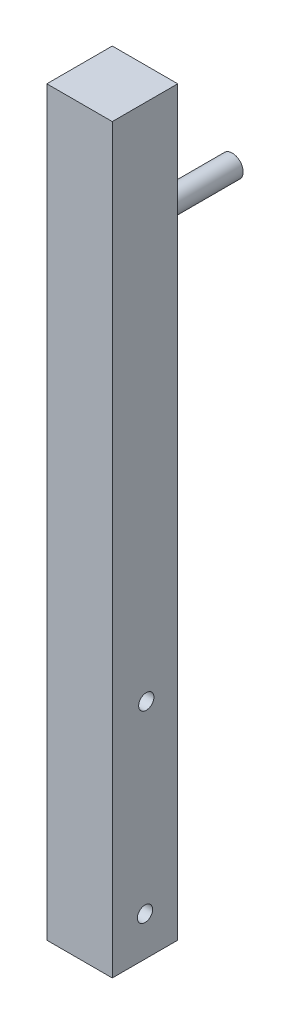
ISO-10303-21;
HEADER;
FILE_DESCRIPTION(('STEP AP214'),'2;1');
FILE_NAME('part.step','',(''),(''),'','','');
FILE_SCHEMA(('AUTOMOTIVE_DESIGN { 1 0 10303 214 1 1 1 1 }'));
ENDSEC;
DATA;
#1=APPLICATION_CONTEXT('core data for automotive mechanical design processes');
#2=APPLICATION_PROTOCOL_DEFINITION('international standard','automotive_design',2000,#1);
#3=PRODUCT_CONTEXT('',#1,'mechanical');
#4=PRODUCT('Part','Part','',(#3));
#5=PRODUCT_RELATED_PRODUCT_CATEGORY('part','',(#4));
#6=PRODUCT_DEFINITION_FORMATION('','',#4);
#7=PRODUCT_DEFINITION_CONTEXT('part definition',#1,'design');
#8=PRODUCT_DEFINITION('design','',#6,#7);
#9=PRODUCT_DEFINITION_SHAPE('','',#8);
#10=(LENGTH_UNIT() NAMED_UNIT(*) SI_UNIT(.MILLI.,.METRE.));
#11=(NAMED_UNIT(*) PLANE_ANGLE_UNIT() SI_UNIT($,.RADIAN.));
#12=(NAMED_UNIT(*) SI_UNIT($,.STERADIAN.) SOLID_ANGLE_UNIT());
#13=UNCERTAINTY_MEASURE_WITH_UNIT(LENGTH_MEASURE(1.E-05),#10,'distance_accuracy_value','');
#14=(GEOMETRIC_REPRESENTATION_CONTEXT(3) GLOBAL_UNCERTAINTY_ASSIGNED_CONTEXT((#13)) GLOBAL_UNIT_ASSIGNED_CONTEXT((#10,
#11,#12)) REPRESENTATION_CONTEXT('',''));
#15=CARTESIAN_POINT('',(0.,0.,0.));
#16=DIRECTION('',(0.,0.,1.));
#17=DIRECTION('',(1.,0.,0.));
#18=AXIS2_PLACEMENT_3D('',#15,#16,#17);
#19=CARTESIAN_POINT('',(-7.5,170.,-7.5));
#20=DIRECTION('',(0.,0.,1.));
#21=DIRECTION('',(1.,0.,0.));
#22=AXIS2_PLACEMENT_3D('',#19,#20,#21);
#23=PLANE('',#22);
#24=DIRECTION('',(-1.,0.,0.));
#25=VECTOR('',#24,1.);
#26=CARTESIAN_POINT('',(-7.5,0.,-7.5));
#27=LINE('',#26,#25);
#28=CARTESIAN_POINT('',(7.5,0.,-7.5));
#29=VERTEX_POINT('',#28);
#30=CARTESIAN_POINT('',(-7.5,0.,-7.5));
#31=VERTEX_POINT('',#30);
#32=EDGE_CURVE('E75',#29,#31,#27,.T.);
#33=ORIENTED_EDGE('',*,*,#32,.T.);
#34=DIRECTION('',(0.,-1.,0.));
#35=VECTOR('',#34,1.);
#36=CARTESIAN_POINT('',(-7.5,170.,-7.5));
#37=LINE('',#36,#35);
#38=CARTESIAN_POINT('',(-7.5,170.,-7.5));
#39=VERTEX_POINT('',#38);
#40=EDGE_CURVE('E98',#39,#31,#37,.T.);
#41=ORIENTED_EDGE('',*,*,#40,.F.);
#42=DIRECTION('',(-1.,0.,0.));
#43=VECTOR('',#42,1.);
#44=CARTESIAN_POINT('',(-7.5,170.,-7.5));
#45=LINE('',#44,#43);
#46=CARTESIAN_POINT('',(7.5,170.,-7.5));
#47=VERTEX_POINT('',#46);
#48=EDGE_CURVE('E52',#47,#39,#45,.T.);
#49=ORIENTED_EDGE('',*,*,#48,.F.);
#50=DIRECTION('',(0.,-1.,0.));
#51=VECTOR('',#50,1.);
#52=CARTESIAN_POINT('',(7.5,170.,-7.5));
#53=LINE('',#52,#51);
#54=EDGE_CURVE('E94',#47,#29,#53,.T.);
#55=ORIENTED_EDGE('',*,*,#54,.T.);
#56=EDGE_LOOP('',(#33,#41,#49,#55));
#57=FACE_BOUND('',#56,.T.);
#58=CARTESIAN_POINT('',(0.,140.,-7.5));
#59=DIRECTION('',(0.,0.,1.));
#60=DIRECTION('',(1.,0.,0.));
#61=AXIS2_PLACEMENT_3D('',#58,#59,#60);
#62=CIRCLE('',#61,2.5);
#63=CARTESIAN_POINT('',(2.5,140.,-7.5));
#64=VERTEX_POINT('',#63);
#65=EDGE_CURVE('E11',#64,#64,#62,.F.);
#66=ORIENTED_EDGE('',*,*,#65,.F.);
#67=EDGE_LOOP('',(#66));
#68=FACE_BOUND('',#67,.T.);
#69=ADVANCED_FACE('F35',(#57,#68),#23,.F.);
#70=CARTESIAN_POINT('',(-7.5,170.,-7.5));
#71=DIRECTION('',(1.,0.,0.));
#72=DIRECTION('',(0.,0.,-1.));
#73=AXIS2_PLACEMENT_3D('',#70,#71,#72);
#74=PLANE('',#73);
#75=CARTESIAN_POINT('',(-7.5,119.,0.));
#76=DIRECTION('',(-1.,0.,0.));
#77=DIRECTION('',(0.,0.,1.));
#78=AXIS2_PLACEMENT_3D('',#75,#76,#77);
#79=CIRCLE('',#78,4.05);
#80=CARTESIAN_POINT('',(-7.5,119.,4.05));
#81=VERTEX_POINT('',#80);
#82=EDGE_CURVE('E254',#81,#81,#79,.T.);
#83=ORIENTED_EDGE('',*,*,#82,.F.);
#84=EDGE_LOOP('',(#83));
#85=FACE_BOUND('',#84,.T.);
#86=CARTESIAN_POINT('',(-7.5,161.,0.));
#87=DIRECTION('',(-1.,0.,0.));
#88=DIRECTION('',(0.,0.,1.));
#89=AXIS2_PLACEMENT_3D('',#86,#87,#88);
#90=CIRCLE('',#89,4.05);
#91=CARTESIAN_POINT('',(-7.5,161.,4.05));
#92=VERTEX_POINT('',#91);
#93=EDGE_CURVE('E261',#92,#92,#90,.T.);
#94=ORIENTED_EDGE('',*,*,#93,.F.);
#95=EDGE_LOOP('',(#94));
#96=FACE_BOUND('',#95,.T.);
#97=CARTESIAN_POINT('',(-7.5,51.,-0.295283965700013));
#98=DIRECTION('',(1.,0.,0.));
#99=DIRECTION('',(0.,0.,-1.));
#100=AXIS2_PLACEMENT_3D('',#97,#98,#99);
#101=CIRCLE('',#100,1.75);
#102=CARTESIAN_POINT('',(-7.5,51.,-2.04528396570001));
#103=VERTEX_POINT('',#102);
#104=EDGE_CURVE('E269',#103,#103,#101,.T.);
#105=ORIENTED_EDGE('',*,*,#104,.T.);
#106=EDGE_LOOP('',(#105));
#107=FACE_BOUND('',#106,.T.);
#108=CARTESIAN_POINT('',(-7.5,9.,0.));
#109=DIRECTION('',(1.,0.,0.));
#110=DIRECTION('',(0.,0.,-1.));
#111=AXIS2_PLACEMENT_3D('',#108,#109,#110);
#112=CIRCLE('',#111,1.75);
#113=CARTESIAN_POINT('',(-7.5,9.,-1.75));
#114=VERTEX_POINT('',#113);
#115=EDGE_CURVE('E105',#114,#114,#112,.T.);
#116=ORIENTED_EDGE('',*,*,#115,.T.);
#117=EDGE_LOOP('',(#116));
#118=FACE_BOUND('',#117,.T.);
#119=DIRECTION('',(0.,0.,1.));
#120=VECTOR('',#119,1.);
#121=CARTESIAN_POINT('',(-7.5,0.,-7.5));
#122=LINE('',#121,#120);
#123=CARTESIAN_POINT('',(-7.5,0.,7.5));
#124=VERTEX_POINT('',#123);
#125=EDGE_CURVE('E102',#31,#124,#122,.T.);
#126=ORIENTED_EDGE('',*,*,#125,.T.);
#127=DIRECTION('',(0.,-1.,0.));
#128=VECTOR('',#127,1.);
#129=CARTESIAN_POINT('',(-7.5,170.,7.5));
#130=LINE('',#129,#128);
#131=CARTESIAN_POINT('',(-7.5,170.,7.5));
#132=VERTEX_POINT('',#131);
#133=EDGE_CURVE('E44',#132,#124,#130,.T.);
#134=ORIENTED_EDGE('',*,*,#133,.F.);
#135=DIRECTION('',(0.,0.,1.));
#136=VECTOR('',#135,1.);
#137=CARTESIAN_POINT('',(-7.5,170.,-7.5));
#138=LINE('',#137,#136);
#139=EDGE_CURVE('E88',#39,#132,#138,.T.);
#140=ORIENTED_EDGE('',*,*,#139,.F.);
#141=ORIENTED_EDGE('',*,*,#40,.T.);
#142=EDGE_LOOP('',(#126,#134,#140,#141));
#143=FACE_BOUND('',#142,.T.);
#144=ADVANCED_FACE('F37',(#85,#96,#107,#118,#143),#74,.F.);
#145=CARTESIAN_POINT('',(-7.5,170.,7.5));
#146=DIRECTION('',(0.,0.,-1.));
#147=DIRECTION('',(-1.,0.,0.));
#148=AXIS2_PLACEMENT_3D('',#145,#146,#147);
#149=PLANE('',#148);
#150=DIRECTION('',(1.,0.,0.));
#151=VECTOR('',#150,1.);
#152=CARTESIAN_POINT('',(-7.5,0.,7.5));
#153=LINE('',#152,#151);
#154=CARTESIAN_POINT('',(7.5,0.,7.5));
#155=VERTEX_POINT('',#154);
#156=EDGE_CURVE('E93',#124,#155,#153,.T.);
#157=ORIENTED_EDGE('',*,*,#156,.T.);
#158=DIRECTION('',(0.,-1.,0.));
#159=VECTOR('',#158,1.);
#160=CARTESIAN_POINT('',(7.5,170.,7.5));
#161=LINE('',#160,#159);
#162=CARTESIAN_POINT('',(7.5,170.,7.5));
#163=VERTEX_POINT('',#162);
#164=EDGE_CURVE('E91',#163,#155,#161,.T.);
#165=ORIENTED_EDGE('',*,*,#164,.F.);
#166=DIRECTION('',(1.,0.,0.));
#167=VECTOR('',#166,1.);
#168=CARTESIAN_POINT('',(-7.5,170.,7.5));
#169=LINE('',#168,#167);
#170=EDGE_CURVE('E83',#132,#163,#169,.T.);
#171=ORIENTED_EDGE('',*,*,#170,.F.);
#172=ORIENTED_EDGE('',*,*,#133,.T.);
#173=EDGE_LOOP('',(#157,#165,#171,#172));
#174=FACE_BOUND('',#173,.T.);
#175=ADVANCED_FACE('F92',(#174),#149,.F.);
#176=CARTESIAN_POINT('',(7.5,170.,-7.5));
#177=DIRECTION('',(-1.,0.,0.));
#178=DIRECTION('',(0.,0.,1.));
#179=AXIS2_PLACEMENT_3D('',#176,#177,#178);
#180=PLANE('',#179);
#181=CARTESIAN_POINT('',(7.5,51.,-0.295283965700013));
#182=DIRECTION('',(1.,0.,0.));
#183=DIRECTION('',(0.,0.,-1.));
#184=AXIS2_PLACEMENT_3D('',#181,#182,#183);
#185=CIRCLE('',#184,1.75);
#186=CARTESIAN_POINT('',(7.5,51.,-2.04528396570001));
#187=VERTEX_POINT('',#186);
#188=EDGE_CURVE('E266',#187,#187,#185,.T.);
#189=ORIENTED_EDGE('',*,*,#188,.F.);
#190=EDGE_LOOP('',(#189));
#191=FACE_BOUND('',#190,.T.);
#192=CARTESIAN_POINT('',(7.5,9.,0.));
#193=DIRECTION('',(1.,0.,0.));
#194=DIRECTION('',(0.,0.,-1.));
#195=AXIS2_PLACEMENT_3D('',#192,#193,#194);
#196=CIRCLE('',#195,1.75);
#197=CARTESIAN_POINT('',(7.5,9.,-1.75));
#198=VERTEX_POINT('',#197);
#199=EDGE_CURVE('E272',#198,#198,#196,.T.);
#200=ORIENTED_EDGE('',*,*,#199,.F.);
#201=EDGE_LOOP('',(#200));
#202=FACE_BOUND('',#201,.T.);
#203=DIRECTION('',(0.,0.,-1.));
#204=VECTOR('',#203,1.);
#205=CARTESIAN_POINT('',(7.5,0.,-7.5));
#206=LINE('',#205,#204);
#207=EDGE_CURVE('E69',#155,#29,#206,.T.);
#208=ORIENTED_EDGE('',*,*,#207,.T.);
#209=ORIENTED_EDGE('',*,*,#54,.F.);
#210=DIRECTION('',(0.,0.,-1.));
#211=VECTOR('',#210,1.);
#212=CARTESIAN_POINT('',(7.5,170.,-7.5));
#213=LINE('',#212,#211);
#214=EDGE_CURVE('E86',#163,#47,#213,.T.);
#215=ORIENTED_EDGE('',*,*,#214,.F.);
#216=ORIENTED_EDGE('',*,*,#164,.T.);
#217=EDGE_LOOP('',(#208,#209,#215,#216));
#218=FACE_BOUND('',#217,.T.);
#219=ADVANCED_FACE('F96',(#191,#202,#218),#180,.F.);
#220=CARTESIAN_POINT('',(-7.5,170.,7.5));
#221=DIRECTION('',(0.,1.,0.));
#222=DIRECTION('',(0.,0.,1.));
#223=AXIS2_PLACEMENT_3D('',#220,#221,#222);
#224=PLANE('',#223);
#225=ORIENTED_EDGE('',*,*,#139,.T.);
#226=ORIENTED_EDGE('',*,*,#170,.T.);
#227=ORIENTED_EDGE('',*,*,#214,.T.);
#228=ORIENTED_EDGE('',*,*,#48,.T.);
#229=EDGE_LOOP('',(#225,#226,#227,#228));
#230=FACE_BOUND('',#229,.T.);
#231=ADVANCED_FACE('F84',(#230),#224,.T.);
#232=CARTESIAN_POINT('',(-7.5,0.,7.5));
#233=DIRECTION('',(0.,1.,0.));
#234=DIRECTION('',(0.,0.,1.));
#235=AXIS2_PLACEMENT_3D('',#232,#233,#234);
#236=PLANE('',#235);
#237=ORIENTED_EDGE('',*,*,#125,.F.);
#238=ORIENTED_EDGE('',*,*,#32,.F.);
#239=ORIENTED_EDGE('',*,*,#207,.F.);
#240=ORIENTED_EDGE('',*,*,#156,.F.);
#241=EDGE_LOOP('',(#237,#238,#239,#240));
#242=FACE_BOUND('',#241,.T.);
#243=ADVANCED_FACE('F113',(#242),#236,.F.);
#244=CARTESIAN_POINT('',(-7.5,9.,0.));
#245=DIRECTION('',(1.,0.,0.));
#246=DIRECTION('',(0.,0.,-1.));
#247=AXIS2_PLACEMENT_3D('',#244,#245,#246);
#248=CYLINDRICAL_SURFACE('',#247,1.75);
#249=ORIENTED_EDGE('',*,*,#115,.F.);
#250=EDGE_LOOP('',(#249));
#251=FACE_BOUND('',#250,.T.);
#252=ORIENTED_EDGE('',*,*,#199,.T.);
#253=EDGE_LOOP('',(#252));
#254=FACE_BOUND('',#253,.T.);
#255=ADVANCED_FACE('F115',(#251,#254),#248,.F.);
#256=CARTESIAN_POINT('',(-7.5,51.,-0.295283965700013));
#257=DIRECTION('',(1.,0.,0.));
#258=DIRECTION('',(0.,0.,-1.));
#259=AXIS2_PLACEMENT_3D('',#256,#257,#258);
#260=CYLINDRICAL_SURFACE('',#259,1.75);
#261=ORIENTED_EDGE('',*,*,#104,.F.);
#262=EDGE_LOOP('',(#261));
#263=FACE_BOUND('',#262,.T.);
#264=ORIENTED_EDGE('',*,*,#188,.T.);
#265=EDGE_LOOP('',(#264));
#266=FACE_BOUND('',#265,.T.);
#267=ADVANCED_FACE('F121',(#263,#266),#260,.F.);
#268=CARTESIAN_POINT('',(2.5,161.,0.));
#269=DIRECTION('',(-1.,0.,0.));
#270=DIRECTION('',(0.,0.,1.));
#271=AXIS2_PLACEMENT_3D('',#268,#269,#270);
#272=CYLINDRICAL_SURFACE('',#271,4.05);
#273=CARTESIAN_POINT('',(2.5,161.,0.));
#274=DIRECTION('',(-1.,0.,0.));
#275=DIRECTION('',(0.,0.,1.));
#276=AXIS2_PLACEMENT_3D('',#273,#274,#275);
#277=CIRCLE('',#276,4.05);
#278=CARTESIAN_POINT('',(2.5,161.,4.05));
#279=VERTEX_POINT('',#278);
#280=EDGE_CURVE('E263',#279,#279,#277,.T.);
#281=ORIENTED_EDGE('',*,*,#280,.F.);
#282=EDGE_LOOP('',(#281));
#283=FACE_BOUND('',#282,.T.);
#284=ORIENTED_EDGE('',*,*,#93,.T.);
#285=EDGE_LOOP('',(#284));
#286=FACE_BOUND('',#285,.T.);
#287=ADVANCED_FACE('F168',(#283,#286),#272,.F.);
#288=CARTESIAN_POINT('',(2.5,161.,0.));
#289=DIRECTION('',(-1.,0.,0.));
#290=DIRECTION('',(0.,0.,1.));
#291=AXIS2_PLACEMENT_3D('',#288,#289,#290);
#292=PLANE('',#291);
#293=ORIENTED_EDGE('',*,*,#280,.T.);
#294=EDGE_LOOP('',(#293));
#295=FACE_BOUND('',#294,.T.);
#296=ADVANCED_FACE('F178',(#295),#292,.T.);
#297=CARTESIAN_POINT('',(2.5,119.,0.));
#298=DIRECTION('',(-1.,0.,0.));
#299=DIRECTION('',(0.,0.,1.));
#300=AXIS2_PLACEMENT_3D('',#297,#298,#299);
#301=CYLINDRICAL_SURFACE('',#300,4.05);
#302=CARTESIAN_POINT('',(2.5,119.,0.));
#303=DIRECTION('',(-1.,0.,0.));
#304=DIRECTION('',(0.,0.,1.));
#305=AXIS2_PLACEMENT_3D('',#302,#303,#304);
#306=CIRCLE('',#305,4.05);
#307=CARTESIAN_POINT('',(2.5,119.,4.05));
#308=VERTEX_POINT('',#307);
#309=EDGE_CURVE('E257',#308,#308,#306,.T.);
#310=ORIENTED_EDGE('',*,*,#309,.F.);
#311=EDGE_LOOP('',(#310));
#312=FACE_BOUND('',#311,.T.);
#313=ORIENTED_EDGE('',*,*,#82,.T.);
#314=EDGE_LOOP('',(#313));
#315=FACE_BOUND('',#314,.T.);
#316=ADVANCED_FACE('F188',(#312,#315),#301,.F.);
#317=CARTESIAN_POINT('',(2.5,119.,0.));
#318=DIRECTION('',(-1.,0.,0.));
#319=DIRECTION('',(0.,0.,1.));
#320=AXIS2_PLACEMENT_3D('',#317,#318,#319);
#321=PLANE('',#320);
#322=ORIENTED_EDGE('',*,*,#309,.T.);
#323=EDGE_LOOP('',(#322));
#324=FACE_BOUND('',#323,.T.);
#325=ADVANCED_FACE('F198',(#324),#321,.T.);
#326=CARTESIAN_POINT('',(0.,140.,-27.5));
#327=DIRECTION('',(0.,0.,1.));
#328=DIRECTION('',(1.,0.,0.));
#329=AXIS2_PLACEMENT_3D('',#326,#327,#328);
#330=CYLINDRICAL_SURFACE('',#329,2.5);
#331=CARTESIAN_POINT('',(0.,140.,-27.5));
#332=DIRECTION('',(0.,0.,-1.));
#333=DIRECTION('',(-1.,0.,0.));
#334=AXIS2_PLACEMENT_3D('',#331,#332,#333);
#335=CIRCLE('',#334,2.5);
#336=CARTESIAN_POINT('',(-2.5,140.,-27.5));
#337=VERTEX_POINT('',#336);
#338=EDGE_CURVE('E253',#337,#337,#335,.T.);
#339=ORIENTED_EDGE('',*,*,#338,.F.);
#340=EDGE_LOOP('',(#339));
#341=FACE_BOUND('',#340,.T.);
#342=ORIENTED_EDGE('',*,*,#65,.T.);
#343=EDGE_LOOP('',(#342));
#344=FACE_BOUND('',#343,.T.);
#345=ADVANCED_FACE('F208',(#341,#344),#330,.T.);
#346=CARTESIAN_POINT('',(0.,140.,-27.5));
#347=DIRECTION('',(0.,0.,-1.));
#348=DIRECTION('',(-1.,0.,0.));
#349=AXIS2_PLACEMENT_3D('',#346,#347,#348);
#350=PLANE('',#349);
#351=ORIENTED_EDGE('',*,*,#338,.T.);
#352=EDGE_LOOP('',(#351));
#353=FACE_BOUND('',#352,.T.);
#354=ADVANCED_FACE('F222',(#353),#350,.T.);
#355=CLOSED_SHELL('',(#69,#144,#175,#219,#231,#243,#255,#267,#287,#296,#316,#325,#345,#354));
#356=MANIFOLD_SOLID_BREP('B2',#355);
#357=ADVANCED_BREP_SHAPE_REPRESENTATION('',(#18,#356),#14);
#358=SHAPE_DEFINITION_REPRESENTATION(#9,#357);
ENDSEC;
END-ISO-10303-21;
